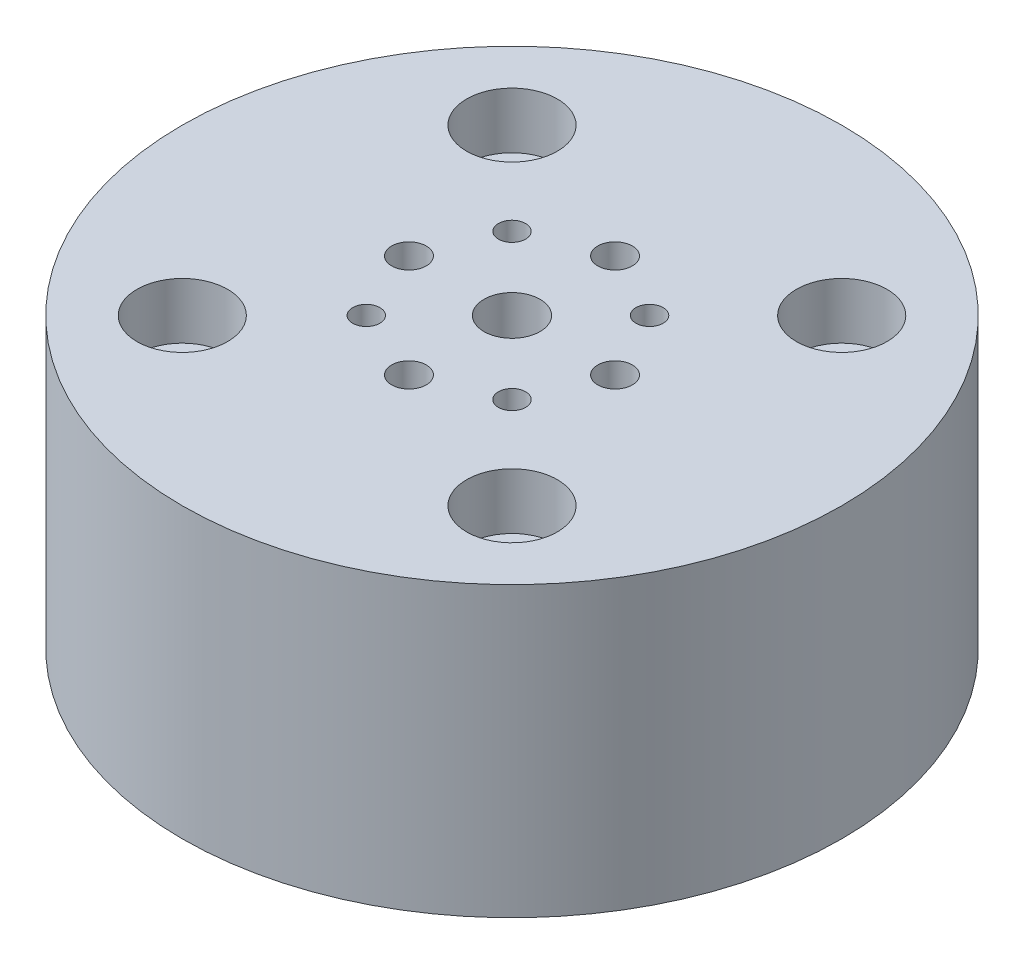
ISO-10303-21;
HEADER;
FILE_DESCRIPTION(('STEP AP214'),'2;1');
FILE_NAME('part.step','',(''),(''),'','','');
FILE_SCHEMA(('AUTOMOTIVE_DESIGN { 1 0 10303 214 1 1 1 1 }'));
ENDSEC;
DATA;
#1=APPLICATION_CONTEXT('core data for automotive mechanical design processes');
#2=APPLICATION_PROTOCOL_DEFINITION('international standard','automotive_design',2000,#1);
#3=PRODUCT_CONTEXT('',#1,'mechanical');
#4=PRODUCT('Part','Part','',(#3));
#5=PRODUCT_RELATED_PRODUCT_CATEGORY('part','',(#4));
#6=PRODUCT_DEFINITION_FORMATION('','',#4);
#7=PRODUCT_DEFINITION_CONTEXT('part definition',#1,'design');
#8=PRODUCT_DEFINITION('design','',#6,#7);
#9=PRODUCT_DEFINITION_SHAPE('','',#8);
#10=(LENGTH_UNIT() NAMED_UNIT(*) SI_UNIT(.MILLI.,.METRE.));
#11=(NAMED_UNIT(*) PLANE_ANGLE_UNIT() SI_UNIT($,.RADIAN.));
#12=(NAMED_UNIT(*) SI_UNIT($,.STERADIAN.) SOLID_ANGLE_UNIT());
#13=UNCERTAINTY_MEASURE_WITH_UNIT(LENGTH_MEASURE(1.E-05),#10,'distance_accuracy_value','');
#14=(GEOMETRIC_REPRESENTATION_CONTEXT(3) GLOBAL_UNCERTAINTY_ASSIGNED_CONTEXT((#13)) GLOBAL_UNIT_ASSIGNED_CONTEXT((#10,
#11,#12)) REPRESENTATION_CONTEXT('',''));
#15=CARTESIAN_POINT('',(0.,0.,0.));
#16=DIRECTION('',(0.,0.,1.));
#17=DIRECTION('',(1.,0.,0.));
#18=AXIS2_PLACEMENT_3D('',#15,#16,#17);
#19=CARTESIAN_POINT('',(0.,35.,0.));
#20=DIRECTION('',(0.,-1.,0.));
#21=DIRECTION('',(0.,0.,-1.));
#22=AXIS2_PLACEMENT_3D('',#19,#20,#21);
#23=CYLINDRICAL_SURFACE('',#22,40.);
#24=CARTESIAN_POINT('',(-17.1947368169029,25.,-36.1156617798628));
#25=CARTESIAN_POINT('',(-17.1947323664606,24.8840909943194,-36.1156643984665));
#26=CARTESIAN_POINT('',(-17.1858855190731,24.768099911168,-36.1198800236044));
#27=CARTESIAN_POINT('',(-17.1507032878378,24.5393178914796,-36.136598365528));
#28=CARTESIAN_POINT('',(-17.1243473274557,24.4265308831518,-36.149110832647));
#29=CARTESIAN_POINT('',(-17.0548559128732,24.2075042348248,-36.1819479586125));
#30=CARTESIAN_POINT('',(-17.0117290480221,24.1012612754539,-36.2022686183693));
#31=CARTESIAN_POINT('',(-16.9098601310666,23.8983055579021,-36.24996245545));
#32=CARTESIAN_POINT('',(-16.8511217518878,23.8015905654,-36.2773339738698));
#33=CARTESIAN_POINT('',(-16.7195367529221,23.6203040089185,-36.3381663516713));
#34=CARTESIAN_POINT('',(-16.6466769583823,23.5357439143212,-36.3716328957112));
#35=CARTESIAN_POINT('',(-16.4888452517058,23.3812653407512,-36.4434559793037));
#36=CARTESIAN_POINT('',(-16.4038728441494,23.3113474609508,-36.4818127188643));
#37=CARTESIAN_POINT('',(-16.2240784376493,23.188106028028,-36.5621247101888));
#38=CARTESIAN_POINT('',(-16.129251136595,23.1347914700836,-36.6040818969207));
#39=CARTESIAN_POINT('',(-15.9323947579528,23.04632780048,-36.6901938859497));
#40=CARTESIAN_POINT('',(-15.8303657375235,23.0111785446647,-36.7343486708041));
#41=CARTESIAN_POINT('',(-15.6220431876525,22.9600737038185,-36.8234243571115));
#42=CARTESIAN_POINT('',(-15.5157535797733,22.944100869252,-36.8683445331304));
#43=CARTESIAN_POINT('',(-15.3018196203172,22.931749043006,-36.9576480579425));
#44=CARTESIAN_POINT('',(-15.1941752799503,22.9353698892986,-37.0020314111717));
#45=CARTESIAN_POINT('',(-14.9807017567811,22.9620883381284,-37.0889720630857));
#46=CARTESIAN_POINT('',(-14.8748709418463,22.9851673754128,-37.1315310617462));
#47=CARTESIAN_POINT('',(-14.667957811744,23.0501182945253,-37.2137530471852));
#48=CARTESIAN_POINT('',(-14.5668755174538,23.0919902589694,-37.2534160212317));
#49=CARTESIAN_POINT('',(-14.3723386834298,23.1933595916023,-37.3289001230808));
#50=CARTESIAN_POINT('',(-14.2788878295692,23.2528654132095,-37.3647193970253));
#51=CARTESIAN_POINT('',(-14.102394183885,23.3878071372108,-37.4316898167842));
#52=CARTESIAN_POINT('',(-14.0193514706958,23.4632431599473,-37.4628409273306));
#53=CARTESIAN_POINT('',(-13.8660264232982,23.6280088764414,-37.5198617430587));
#54=CARTESIAN_POINT('',(-13.7957590904456,23.7173546780933,-37.5457252436978));
#55=CARTESIAN_POINT('',(-13.6701930220048,23.9073471834221,-37.5916254852837));
#56=CARTESIAN_POINT('',(-13.6148942905948,24.0079938902534,-37.6116622246041));
#57=CARTESIAN_POINT('',(-13.5209221243251,24.2177410741905,-37.6455465164637));
#58=CARTESIAN_POINT('',(-13.4822492699932,24.326841846331,-37.6593938528873));
#59=CARTESIAN_POINT('',(-13.422701806529,24.5503957291421,-37.6806592901101));
#60=CARTESIAN_POINT('',(-13.4018270546926,24.6648487968906,-37.688077442458));
#61=CARTESIAN_POINT('',(-13.378524064688,24.8957169313661,-37.696355923557));
#62=CARTESIAN_POINT('',(-13.3760745648113,25.0121295812575,-37.6972238109508));
#63=CARTESIAN_POINT('',(-13.389640495353,25.2437366769446,-37.692407421333));
#64=CARTESIAN_POINT('',(-13.4056558606038,25.3589311270383,-37.6867231674457));
#65=CARTESIAN_POINT('',(-13.4556509223476,25.5847685222988,-37.6689016917543));
#66=CARTESIAN_POINT('',(-13.4896208929858,25.6954138967212,-37.6567679635546));
#67=CARTESIAN_POINT('',(-13.5744933208321,25.9090871745565,-37.626256164323));
#68=CARTESIAN_POINT('',(-13.6253958825829,26.0121150309336,-37.6078780547381));
#69=CARTESIAN_POINT('',(-13.7426623543366,26.2077323494296,-37.5651848622188));
#70=CARTESIAN_POINT('',(-13.8090403965077,26.3003121550391,-37.5408643517187));
#71=CARTESIAN_POINT('',(-13.9552580238635,26.4723082187152,-37.4867554508254));
#72=CARTESIAN_POINT('',(-14.0350977004694,26.551724387377,-37.456967023298));
#73=CARTESIAN_POINT('',(-14.2059651277723,26.6952146187777,-37.3924977063089));
#74=CARTESIAN_POINT('',(-14.2970033732326,26.759274121665,-37.3578122229941));
#75=CARTESIAN_POINT('',(-14.4875388567151,26.8701330603534,-37.2843349099567));
#76=CARTESIAN_POINT('',(-14.5870360561024,26.9169325749813,-37.2455430989889));
#77=CARTESIAN_POINT('',(-14.7915425247515,26.9919176273634,-37.1647997343942));
#78=CARTESIAN_POINT('',(-14.8965490108527,27.0201124678551,-37.1228497716199));
#79=CARTESIAN_POINT('',(-15.1090889651991,27.0571182864119,-37.0368541763514));
#80=CARTESIAN_POINT('',(-15.2166224179383,27.0659293833891,-36.992808556715));
#81=CARTESIAN_POINT('',(-15.4310155799614,27.0639164693807,-36.9038915398826));
#82=CARTESIAN_POINT('',(-15.5378759275429,27.0531152904625,-36.859021163036));
#83=CARTESIAN_POINT('',(-15.7480333355551,27.0122316453215,-36.7697224197646));
#84=CARTESIAN_POINT('',(-15.851330389319,26.9821491430258,-36.725294054167));
#85=CARTESIAN_POINT('',(-16.0514820353814,26.9035615224324,-36.6382565646145));
#86=CARTESIAN_POINT('',(-16.1483365893418,26.8550562945164,-36.5956474514861));
#87=CARTESIAN_POINT('',(-16.3329349899164,26.7410039417887,-36.513633741812));
#88=CARTESIAN_POINT('',(-16.4206791109799,26.6754573305529,-36.4742290487418));
#89=CARTESIAN_POINT('',(-16.5847611493458,26.5291006605521,-36.3999152910998));
#90=CARTESIAN_POINT('',(-16.6610869491391,26.4482745896786,-36.3650110078639));
#91=CARTESIAN_POINT('',(-16.8001779531628,26.2736656996904,-36.3009628117162));
#92=CARTESIAN_POINT('',(-16.8629398184759,26.1798796996346,-36.2718203172845));
#93=CARTESIAN_POINT('',(-16.9732464523444,25.9819355110187,-36.2203344215197));
#94=CARTESIAN_POINT('',(-17.02077605627,25.877767120554,-36.1979977969209));
#95=CARTESIAN_POINT('',(-17.099214821967,25.6621662113375,-36.161011473089));
#96=CARTESIAN_POINT('',(-17.1301435962816,25.5507424396017,-36.1463527035858));
#97=CARTESIAN_POINT('',(-17.1664554527054,25.3655230080593,-36.1291161325999));
#98=CARTESIAN_POINT('',(-17.1770481276471,25.2929267774144,-36.1240789492848));
#99=CARTESIAN_POINT('',(-17.1911902169048,25.1468980216171,-36.1173509445894));
#100=CARTESIAN_POINT('',(-17.1947396376842,25.0734654972321,-36.1156601201382));
#101=CARTESIAN_POINT('',(-17.1947368169029,25.,-36.1156617798628));
#102=B_SPLINE_CURVE_WITH_KNOTS('',3,(#24,#25,#26,#27,#28,#29,#30,#31,#32,#33,#34,#35,#36,#37,
#38,#39,#40,#41,#42,#43,#44,#45,#46,#47,#48,#49,#50,#51,#52,#53,#54,#55,#56,#57,#58,#59,#60,#61,
#62,#63,#64,#65,#66,#67,#68,#69,#70,#71,#72,#73,#74,#75,#76,#77,#78,#79,#80,#81,#82,#83,#84,#85,
#86,#87,#88,#89,#90,#91,#92,#93,#94,#95,#96,#97,#98,#99,#100,#101),.UNSPECIFIED.,.T.,.F.,(4,2,2,
2,2,2,2,2,2,2,2,2,2,2,2,2,2,2,2,2,2,2,2,2,2,2,2,2,2,2,2,2,2,2,2,2,2,2,4),(0.,0.347458837639243,
0.695326729464623,1.04301669219222,1.39062492609941,1.73855904031264,2.08650738951548,
2.43464391998632,2.7827776876714,3.13059806757956,3.47841557122855,3.82590159380766,
4.17338914399238,4.52104354495177,4.86870057231195,5.21676323218792,5.56482598921682,
5.91290089860983,6.26097301713489,6.60864341822748,6.95631259229902,7.30379362970335,
7.65127681251336,7.99907856765509,8.34688268489929,8.69501526691774,9.04314625898657,
9.39110304589265,9.73905769820744,10.0866075310555,10.4341580141263,10.7817105652128,
11.1292526433265,11.4771609676402,11.8251548362552,12.1734940850958,12.5214208882537,
12.7416476044565,12.9618741185652),.UNSPECIFIED.);
#103=CARTESIAN_POINT('',(-17.1947368169029,25.,-36.1156617798628));
#104=VERTEX_POINT('',#103);
#105=EDGE_CURVE('E109',#104,#104,#102,.T.);
#106=ORIENTED_EDGE('',*,*,#105,.T.);
#107=EDGE_LOOP('',(#106));
#108=FACE_BOUND('',#107,.T.);
#109=CARTESIAN_POINT('',(0.,35.,0.));
#110=DIRECTION('',(0.,1.,0.));
#111=DIRECTION('',(0.,0.,1.));
#112=AXIS2_PLACEMENT_3D('',#109,#110,#111);
#113=CIRCLE('',#112,40.);
#114=CARTESIAN_POINT('',(0.,35.,40.));
#115=VERTEX_POINT('',#114);
#116=EDGE_CURVE('E11',#115,#115,#113,.T.);
#117=ORIENTED_EDGE('',*,*,#116,.F.);
#118=EDGE_LOOP('',(#117));
#119=FACE_BOUND('',#118,.T.);
#120=CARTESIAN_POINT('',(0.,0.,0.));
#121=DIRECTION('',(0.,1.,0.));
#122=DIRECTION('',(0.,0.,1.));
#123=AXIS2_PLACEMENT_3D('',#120,#121,#122);
#124=CIRCLE('',#123,40.);
#125=CARTESIAN_POINT('',(0.,0.,40.));
#126=VERTEX_POINT('',#125);
#127=EDGE_CURVE('E60',#126,#126,#124,.T.);
#128=ORIENTED_EDGE('',*,*,#127,.T.);
#129=EDGE_LOOP('',(#128));
#130=FACE_BOUND('',#129,.T.);
#131=ADVANCED_FACE('F45',(#108,#119,#130),#23,.T.);
#132=CARTESIAN_POINT('',(0.,35.,0.));
#133=DIRECTION('',(0.,1.,0.));
#134=DIRECTION('',(0.,0.,1.));
#135=AXIS2_PLACEMENT_3D('',#132,#133,#134);
#136=PLANE('',#135);
#137=CARTESIAN_POINT('',(0.,35.,0.));
#138=DIRECTION('',(0.,1.,0.));
#139=DIRECTION('',(0.,0.,1.));
#140=AXIS2_PLACEMENT_3D('',#137,#138,#139);
#141=CIRCLE('',#140,3.4);
#142=CARTESIAN_POINT('',(0.,35.,3.4));
#143=VERTEX_POINT('',#142);
#144=EDGE_CURVE('E101',#143,#143,#141,.T.);
#145=ORIENTED_EDGE('',*,*,#144,.F.);
#146=EDGE_LOOP('',(#145));
#147=FACE_BOUND('',#146,.T.);
#148=CARTESIAN_POINT('',(-8.83883476483184,35.,-8.83883476483186));
#149=DIRECTION('',(0.,1.,0.));
#150=DIRECTION('',(0.,0.,1.));
#151=AXIS2_PLACEMENT_3D('',#148,#149,#150);
#152=CIRCLE('',#151,1.65);
#153=CARTESIAN_POINT('',(-8.83883476483184,35.,-7.18883476483186));
#154=VERTEX_POINT('',#153);
#155=EDGE_CURVE('E100',#154,#154,#152,.T.);
#156=ORIENTED_EDGE('',*,*,#155,.F.);
#157=EDGE_LOOP('',(#156));
#158=FACE_BOUND('',#157,.T.);
#159=CARTESIAN_POINT('',(8.34372006827231,35.,-8.34372006827231));
#160=DIRECTION('',(0.,1.,0.));
#161=DIRECTION('',(0.,0.,1.));
#162=AXIS2_PLACEMENT_3D('',#159,#160,#161);
#163=CIRCLE('',#162,1.65);
#164=CARTESIAN_POINT('',(8.34372006827231,35.,-6.69372006827231));
#165=VERTEX_POINT('',#164);
#166=EDGE_CURVE('E116',#165,#165,#163,.T.);
#167=ORIENTED_EDGE('',*,*,#166,.F.);
#168=EDGE_LOOP('',(#167));
#169=FACE_BOUND('',#168,.T.);
#170=CARTESIAN_POINT('',(8.8388347648319,35.,8.83883476483179));
#171=DIRECTION('',(0.,1.,0.));
#172=DIRECTION('',(0.,0.,1.));
#173=AXIS2_PLACEMENT_3D('',#170,#171,#172);
#174=CIRCLE('',#173,1.65);
#175=CARTESIAN_POINT('',(8.8388347648319,35.,10.4888347648318));
#176=VERTEX_POINT('',#175);
#177=EDGE_CURVE('E124',#176,#176,#174,.T.);
#178=ORIENTED_EDGE('',*,*,#177,.F.);
#179=EDGE_LOOP('',(#178));
#180=FACE_BOUND('',#179,.T.);
#181=CARTESIAN_POINT('',(-8.83883476483182,35.,8.83883476483187));
#182=DIRECTION('',(0.,1.,0.));
#183=DIRECTION('',(0.,0.,1.));
#184=AXIS2_PLACEMENT_3D('',#181,#182,#183);
#185=CIRCLE('',#184,1.65);
#186=CARTESIAN_POINT('',(-8.83883476483182,35.,10.4888347648319));
#187=VERTEX_POINT('',#186);
#188=EDGE_CURVE('E132',#187,#187,#185,.T.);
#189=ORIENTED_EDGE('',*,*,#188,.F.);
#190=EDGE_LOOP('',(#189));
#191=FACE_BOUND('',#190,.T.);
#192=CARTESIAN_POINT('',(0.,35.,-12.5));
#193=DIRECTION('',(0.,1.,0.));
#194=DIRECTION('',(0.,0.,1.));
#195=AXIS2_PLACEMENT_3D('',#192,#193,#194);
#196=CIRCLE('',#195,2.1);
#197=CARTESIAN_POINT('',(0.,35.,-10.4));
#198=VERTEX_POINT('',#197);
#199=EDGE_CURVE('E140',#198,#198,#196,.T.);
#200=ORIENTED_EDGE('',*,*,#199,.F.);
#201=EDGE_LOOP('',(#200));
#202=FACE_BOUND('',#201,.T.);
#203=CARTESIAN_POINT('',(0.,35.,12.5));
#204=DIRECTION('',(0.,1.,0.));
#205=DIRECTION('',(0.,0.,1.));
#206=AXIS2_PLACEMENT_3D('',#203,#204,#205);
#207=CIRCLE('',#206,2.1);
#208=CARTESIAN_POINT('',(0.,35.,14.6));
#209=VERTEX_POINT('',#208);
#210=EDGE_CURVE('E148',#209,#209,#207,.T.);
#211=ORIENTED_EDGE('',*,*,#210,.F.);
#212=EDGE_LOOP('',(#211));
#213=FACE_BOUND('',#212,.T.);
#214=CARTESIAN_POINT('',(12.5,35.,-1.03686900335528E-13));
#215=DIRECTION('',(0.,1.,0.));
#216=DIRECTION('',(0.,0.,1.));
#217=AXIS2_PLACEMENT_3D('',#214,#215,#216);
#218=CIRCLE('',#217,2.1);
#219=CARTESIAN_POINT('',(12.5,35.,2.09999999999989));
#220=VERTEX_POINT('',#219);
#221=EDGE_CURVE('E156',#220,#220,#218,.T.);
#222=ORIENTED_EDGE('',*,*,#221,.F.);
#223=EDGE_LOOP('',(#222));
#224=FACE_BOUND('',#223,.T.);
#225=CARTESIAN_POINT('',(-12.5,35.,0.));
#226=DIRECTION('',(0.,1.,0.));
#227=DIRECTION('',(0.,0.,1.));
#228=AXIS2_PLACEMENT_3D('',#225,#226,#227);
#229=CIRCLE('',#228,2.1);
#230=CARTESIAN_POINT('',(-12.5,35.,2.1));
#231=VERTEX_POINT('',#230);
#232=EDGE_CURVE('E164',#231,#231,#229,.T.);
#233=ORIENTED_EDGE('',*,*,#232,.F.);
#234=EDGE_LOOP('',(#233));
#235=FACE_BOUND('',#234,.T.);
#236=CARTESIAN_POINT('',(-20.,35.,-20.));
#237=DIRECTION('',(0.,1.,0.));
#238=DIRECTION('',(0.,0.,1.));
#239=AXIS2_PLACEMENT_3D('',#236,#237,#238);
#240=CIRCLE('',#239,5.5);
#241=CARTESIAN_POINT('',(-20.,35.,-14.5));
#242=VERTEX_POINT('',#241);
#243=EDGE_CURVE('E172',#242,#242,#240,.T.);
#244=ORIENTED_EDGE('',*,*,#243,.F.);
#245=EDGE_LOOP('',(#244));
#246=FACE_BOUND('',#245,.T.);
#247=CARTESIAN_POINT('',(20.,35.,-20.));
#248=DIRECTION('',(0.,1.,0.));
#249=DIRECTION('',(0.,0.,1.));
#250=AXIS2_PLACEMENT_3D('',#247,#248,#249);
#251=CIRCLE('',#250,5.5);
#252=CARTESIAN_POINT('',(20.,35.,-14.5));
#253=VERTEX_POINT('',#252);
#254=EDGE_CURVE('E185',#253,#253,#251,.T.);
#255=ORIENTED_EDGE('',*,*,#254,.F.);
#256=EDGE_LOOP('',(#255));
#257=FACE_BOUND('',#256,.T.);
#258=CARTESIAN_POINT('',(20.,35.,20.));
#259=DIRECTION('',(0.,1.,0.));
#260=DIRECTION('',(0.,0.,1.));
#261=AXIS2_PLACEMENT_3D('',#258,#259,#260);
#262=CIRCLE('',#261,5.5);
#263=CARTESIAN_POINT('',(20.,35.,25.5));
#264=VERTEX_POINT('',#263);
#265=EDGE_CURVE('E198',#264,#264,#262,.T.);
#266=ORIENTED_EDGE('',*,*,#265,.F.);
#267=EDGE_LOOP('',(#266));
#268=FACE_BOUND('',#267,.T.);
#269=CARTESIAN_POINT('',(-20.,35.,20.));
#270=DIRECTION('',(0.,1.,0.));
#271=DIRECTION('',(0.,0.,1.));
#272=AXIS2_PLACEMENT_3D('',#269,#270,#271);
#273=CIRCLE('',#272,5.5);
#274=CARTESIAN_POINT('',(-20.,35.,25.5));
#275=VERTEX_POINT('',#274);
#276=EDGE_CURVE('E211',#275,#275,#273,.T.);
#277=ORIENTED_EDGE('',*,*,#276,.F.);
#278=EDGE_LOOP('',(#277));
#279=FACE_BOUND('',#278,.T.);
#280=ORIENTED_EDGE('',*,*,#116,.T.);
#281=EDGE_LOOP('',(#280));
#282=FACE_BOUND('',#281,.T.);
#283=ADVANCED_FACE('F259',(#147,#158,#169,#180,#191,#202,#213,#224,#235,#246,#257,#268,#279,
#282),#136,.T.);
#284=CARTESIAN_POINT('',(0.,0.,0.));
#285=DIRECTION('',(0.,1.,0.));
#286=DIRECTION('',(0.,0.,1.));
#287=AXIS2_PLACEMENT_3D('',#284,#285,#286);
#288=PLANE('',#287);
#289=CARTESIAN_POINT('',(-20.,0.,-20.));
#290=DIRECTION('',(0.,1.,0.));
#291=DIRECTION('',(0.,0.,1.));
#292=AXIS2_PLACEMENT_3D('',#289,#290,#291);
#293=CIRCLE('',#292,3.29999999999999);
#294=CARTESIAN_POINT('',(-20.,0.,-16.7));
#295=VERTEX_POINT('',#294);
#296=EDGE_CURVE('E184',#295,#295,#293,.T.);
#297=ORIENTED_EDGE('',*,*,#296,.T.);
#298=EDGE_LOOP('',(#297));
#299=FACE_BOUND('',#298,.T.);
#300=CARTESIAN_POINT('',(20.,0.,-20.));
#301=DIRECTION('',(0.,1.,0.));
#302=DIRECTION('',(0.,0.,1.));
#303=AXIS2_PLACEMENT_3D('',#300,#301,#302);
#304=CIRCLE('',#303,3.29999999999999);
#305=CARTESIAN_POINT('',(20.,0.,-16.7));
#306=VERTEX_POINT('',#305);
#307=EDGE_CURVE('E197',#306,#306,#304,.T.);
#308=ORIENTED_EDGE('',*,*,#307,.T.);
#309=EDGE_LOOP('',(#308));
#310=FACE_BOUND('',#309,.T.);
#311=CARTESIAN_POINT('',(20.,0.,20.));
#312=DIRECTION('',(0.,1.,0.));
#313=DIRECTION('',(0.,0.,1.));
#314=AXIS2_PLACEMENT_3D('',#311,#312,#313);
#315=CIRCLE('',#314,3.29999999999999);
#316=CARTESIAN_POINT('',(20.,0.,23.3));
#317=VERTEX_POINT('',#316);
#318=EDGE_CURVE('E210',#317,#317,#315,.T.);
#319=ORIENTED_EDGE('',*,*,#318,.T.);
#320=EDGE_LOOP('',(#319));
#321=FACE_BOUND('',#320,.T.);
#322=CARTESIAN_POINT('',(-20.,0.,20.));
#323=DIRECTION('',(0.,1.,0.));
#324=DIRECTION('',(0.,0.,1.));
#325=AXIS2_PLACEMENT_3D('',#322,#323,#324);
#326=CIRCLE('',#325,3.29999999999999);
#327=CARTESIAN_POINT('',(-20.,0.,23.3));
#328=VERTEX_POINT('',#327);
#329=EDGE_CURVE('E222',#328,#328,#326,.T.);
#330=ORIENTED_EDGE('',*,*,#329,.T.);
#331=EDGE_LOOP('',(#330));
#332=FACE_BOUND('',#331,.T.);
#333=ORIENTED_EDGE('',*,*,#127,.F.);
#334=EDGE_LOOP('',(#333));
#335=FACE_BOUND('',#334,.T.);
#336=ADVANCED_FACE('F239',(#299,#310,#321,#332,#335),#288,.F.);
#337=CARTESIAN_POINT('',(-20.,35.,20.));
#338=DIRECTION('',(0.,1.,0.));
#339=DIRECTION('',(0.,0.,1.));
#340=AXIS2_PLACEMENT_3D('',#337,#338,#339);
#341=CYLINDRICAL_SURFACE('',#340,3.29999999999999);
#342=CARTESIAN_POINT('',(-20.,28.2,20.));
#343=DIRECTION('',(0.,1.,0.));
#344=DIRECTION('',(0.,0.,1.));
#345=AXIS2_PLACEMENT_3D('',#342,#343,#344);
#346=CIRCLE('',#345,3.3);
#347=CARTESIAN_POINT('',(-20.,28.2,23.3));
#348=VERTEX_POINT('',#347);
#349=EDGE_CURVE('E219',#348,#348,#346,.T.);
#350=ORIENTED_EDGE('',*,*,#349,.T.);
#351=EDGE_LOOP('',(#350));
#352=FACE_BOUND('',#351,.T.);
#353=ORIENTED_EDGE('',*,*,#329,.F.);
#354=EDGE_LOOP('',(#353));
#355=FACE_BOUND('',#354,.T.);
#356=ADVANCED_FACE('F274',(#352,#355),#341,.F.);
#357=CARTESIAN_POINT('',(-16.7,28.2,20.));
#358=DIRECTION('',(0.,-1.,0.));
#359=DIRECTION('',(0.,0.,-1.));
#360=AXIS2_PLACEMENT_3D('',#357,#358,#359);
#361=PLANE('',#360);
#362=ORIENTED_EDGE('',*,*,#349,.F.);
#363=EDGE_LOOP('',(#362));
#364=FACE_BOUND('',#363,.T.);
#365=CARTESIAN_POINT('',(-20.,28.2,20.));
#366=DIRECTION('',(0.,1.,0.));
#367=DIRECTION('',(0.,0.,1.));
#368=AXIS2_PLACEMENT_3D('',#365,#366,#367);
#369=CIRCLE('',#368,5.5);
#370=CARTESIAN_POINT('',(-20.,28.2,25.5));
#371=VERTEX_POINT('',#370);
#372=EDGE_CURVE('E215',#371,#371,#369,.T.);
#373=ORIENTED_EDGE('',*,*,#372,.T.);
#374=EDGE_LOOP('',(#373));
#375=FACE_BOUND('',#374,.T.);
#376=ADVANCED_FACE('F278',(#364,#375),#361,.F.);
#377=CARTESIAN_POINT('',(-20.,35.,20.));
#378=DIRECTION('',(0.,1.,0.));
#379=DIRECTION('',(0.,0.,1.));
#380=AXIS2_PLACEMENT_3D('',#377,#378,#379);
#381=CYLINDRICAL_SURFACE('',#380,5.5);
#382=ORIENTED_EDGE('',*,*,#372,.F.);
#383=EDGE_LOOP('',(#382));
#384=FACE_BOUND('',#383,.T.);
#385=ORIENTED_EDGE('',*,*,#276,.T.);
#386=EDGE_LOOP('',(#385));
#387=FACE_BOUND('',#386,.T.);
#388=ADVANCED_FACE('F284',(#384,#387),#381,.F.);
#389=CARTESIAN_POINT('',(20.,35.,20.));
#390=DIRECTION('',(0.,1.,0.));
#391=DIRECTION('',(0.,0.,1.));
#392=AXIS2_PLACEMENT_3D('',#389,#390,#391);
#393=CYLINDRICAL_SURFACE('',#392,3.29999999999999);
#394=CARTESIAN_POINT('',(20.,28.2,20.));
#395=DIRECTION('',(0.,1.,0.));
#396=DIRECTION('',(0.,0.,1.));
#397=AXIS2_PLACEMENT_3D('',#394,#395,#396);
#398=CIRCLE('',#397,3.3);
#399=CARTESIAN_POINT('',(20.,28.2,23.3));
#400=VERTEX_POINT('',#399);
#401=EDGE_CURVE('E206',#400,#400,#398,.T.);
#402=ORIENTED_EDGE('',*,*,#401,.T.);
#403=EDGE_LOOP('',(#402));
#404=FACE_BOUND('',#403,.T.);
#405=ORIENTED_EDGE('',*,*,#318,.F.);
#406=EDGE_LOOP('',(#405));
#407=FACE_BOUND('',#406,.T.);
#408=ADVANCED_FACE('F288',(#404,#407),#393,.F.);
#409=CARTESIAN_POINT('',(23.3,28.2,20.));
#410=DIRECTION('',(0.,-1.,0.));
#411=DIRECTION('',(0.,0.,-1.));
#412=AXIS2_PLACEMENT_3D('',#409,#410,#411);
#413=PLANE('',#412);
#414=ORIENTED_EDGE('',*,*,#401,.F.);
#415=EDGE_LOOP('',(#414));
#416=FACE_BOUND('',#415,.T.);
#417=CARTESIAN_POINT('',(20.,28.2,20.));
#418=DIRECTION('',(0.,1.,0.));
#419=DIRECTION('',(0.,0.,1.));
#420=AXIS2_PLACEMENT_3D('',#417,#418,#419);
#421=CIRCLE('',#420,5.5);
#422=CARTESIAN_POINT('',(20.,28.2,25.5));
#423=VERTEX_POINT('',#422);
#424=EDGE_CURVE('E202',#423,#423,#421,.T.);
#425=ORIENTED_EDGE('',*,*,#424,.T.);
#426=EDGE_LOOP('',(#425));
#427=FACE_BOUND('',#426,.T.);
#428=ADVANCED_FACE('F292',(#416,#427),#413,.F.);
#429=CARTESIAN_POINT('',(20.,35.,20.));
#430=DIRECTION('',(0.,1.,0.));
#431=DIRECTION('',(0.,0.,1.));
#432=AXIS2_PLACEMENT_3D('',#429,#430,#431);
#433=CYLINDRICAL_SURFACE('',#432,5.5);
#434=ORIENTED_EDGE('',*,*,#424,.F.);
#435=EDGE_LOOP('',(#434));
#436=FACE_BOUND('',#435,.T.);
#437=ORIENTED_EDGE('',*,*,#265,.T.);
#438=EDGE_LOOP('',(#437));
#439=FACE_BOUND('',#438,.T.);
#440=ADVANCED_FACE('F296',(#436,#439),#433,.F.);
#441=CARTESIAN_POINT('',(20.,35.,-20.));
#442=DIRECTION('',(0.,1.,0.));
#443=DIRECTION('',(0.,0.,1.));
#444=AXIS2_PLACEMENT_3D('',#441,#442,#443);
#445=CYLINDRICAL_SURFACE('',#444,3.29999999999999);
#446=CARTESIAN_POINT('',(20.,28.2,-20.));
#447=DIRECTION('',(0.,1.,0.));
#448=DIRECTION('',(0.,0.,1.));
#449=AXIS2_PLACEMENT_3D('',#446,#447,#448);
#450=CIRCLE('',#449,3.3);
#451=CARTESIAN_POINT('',(20.,28.2,-16.7));
#452=VERTEX_POINT('',#451);
#453=EDGE_CURVE('E193',#452,#452,#450,.T.);
#454=ORIENTED_EDGE('',*,*,#453,.T.);
#455=EDGE_LOOP('',(#454));
#456=FACE_BOUND('',#455,.T.);
#457=ORIENTED_EDGE('',*,*,#307,.F.);
#458=EDGE_LOOP('',(#457));
#459=FACE_BOUND('',#458,.T.);
#460=ADVANCED_FACE('F300',(#456,#459),#445,.F.);
#461=CARTESIAN_POINT('',(23.3,28.2,-20.));
#462=DIRECTION('',(0.,-1.,0.));
#463=DIRECTION('',(0.,0.,-1.));
#464=AXIS2_PLACEMENT_3D('',#461,#462,#463);
#465=PLANE('',#464);
#466=ORIENTED_EDGE('',*,*,#453,.F.);
#467=EDGE_LOOP('',(#466));
#468=FACE_BOUND('',#467,.T.);
#469=CARTESIAN_POINT('',(20.,28.2,-20.));
#470=DIRECTION('',(0.,1.,0.));
#471=DIRECTION('',(0.,0.,1.));
#472=AXIS2_PLACEMENT_3D('',#469,#470,#471);
#473=CIRCLE('',#472,5.5);
#474=CARTESIAN_POINT('',(20.,28.2,-14.5));
#475=VERTEX_POINT('',#474);
#476=EDGE_CURVE('E189',#475,#475,#473,.T.);
#477=ORIENTED_EDGE('',*,*,#476,.T.);
#478=EDGE_LOOP('',(#477));
#479=FACE_BOUND('',#478,.T.);
#480=ADVANCED_FACE('F255',(#468,#479),#465,.F.);
#481=CARTESIAN_POINT('',(20.,35.,-20.));
#482=DIRECTION('',(0.,1.,0.));
#483=DIRECTION('',(0.,0.,1.));
#484=AXIS2_PLACEMENT_3D('',#481,#482,#483);
#485=CYLINDRICAL_SURFACE('',#484,5.5);
#486=ORIENTED_EDGE('',*,*,#476,.F.);
#487=EDGE_LOOP('',(#486));
#488=FACE_BOUND('',#487,.T.);
#489=ORIENTED_EDGE('',*,*,#254,.T.);
#490=EDGE_LOOP('',(#489));
#491=FACE_BOUND('',#490,.T.);
#492=ADVANCED_FACE('F245',(#488,#491),#485,.F.);
#493=CARTESIAN_POINT('',(-20.,35.,-20.));
#494=DIRECTION('',(0.,1.,0.));
#495=DIRECTION('',(0.,0.,1.));
#496=AXIS2_PLACEMENT_3D('',#493,#494,#495);
#497=CYLINDRICAL_SURFACE('',#496,3.29999999999999);
#498=CARTESIAN_POINT('',(-20.,28.2,-20.));
#499=DIRECTION('',(0.,1.,0.));
#500=DIRECTION('',(0.,0.,1.));
#501=AXIS2_PLACEMENT_3D('',#498,#499,#500);
#502=CIRCLE('',#501,3.3);
#503=CARTESIAN_POINT('',(-20.,28.2,-16.7));
#504=VERTEX_POINT('',#503);
#505=EDGE_CURVE('E180',#504,#504,#502,.T.);
#506=ORIENTED_EDGE('',*,*,#505,.T.);
#507=EDGE_LOOP('',(#506));
#508=FACE_BOUND('',#507,.T.);
#509=ORIENTED_EDGE('',*,*,#296,.F.);
#510=EDGE_LOOP('',(#509));
#511=FACE_BOUND('',#510,.T.);
#512=ADVANCED_FACE('F242',(#508,#511),#497,.F.);
#513=CARTESIAN_POINT('',(-16.7,28.2,-20.));
#514=DIRECTION('',(0.,-1.,0.));
#515=DIRECTION('',(0.,0.,-1.));
#516=AXIS2_PLACEMENT_3D('',#513,#514,#515);
#517=PLANE('',#516);
#518=ORIENTED_EDGE('',*,*,#505,.F.);
#519=EDGE_LOOP('',(#518));
#520=FACE_BOUND('',#519,.T.);
#521=CARTESIAN_POINT('',(-20.,28.2,-20.));
#522=DIRECTION('',(0.,1.,0.));
#523=DIRECTION('',(0.,0.,1.));
#524=AXIS2_PLACEMENT_3D('',#521,#522,#523);
#525=CIRCLE('',#524,5.5);
#526=CARTESIAN_POINT('',(-20.,28.2,-14.5));
#527=VERTEX_POINT('',#526);
#528=EDGE_CURVE('E176',#527,#527,#525,.T.);
#529=ORIENTED_EDGE('',*,*,#528,.T.);
#530=EDGE_LOOP('',(#529));
#531=FACE_BOUND('',#530,.T.);
#532=ADVANCED_FACE('F244',(#520,#531),#517,.F.);
#533=CARTESIAN_POINT('',(-20.,35.,-20.));
#534=DIRECTION('',(0.,1.,0.));
#535=DIRECTION('',(0.,0.,1.));
#536=AXIS2_PLACEMENT_3D('',#533,#534,#535);
#537=CYLINDRICAL_SURFACE('',#536,5.5);
#538=ORIENTED_EDGE('',*,*,#528,.F.);
#539=EDGE_LOOP('',(#538));
#540=FACE_BOUND('',#539,.T.);
#541=ORIENTED_EDGE('',*,*,#243,.T.);
#542=EDGE_LOOP('',(#541));
#543=FACE_BOUND('',#542,.T.);
#544=ADVANCED_FACE('F252',(#540,#543),#537,.F.);
#545=CARTESIAN_POINT('',(-12.5,22.6,0.));
#546=DIRECTION('',(0.,1.,0.));
#547=DIRECTION('',(0.,0.,1.));
#548=AXIS2_PLACEMENT_3D('',#545,#546,#547);
#549=CONICAL_SURFACE('',#548,2.1,1.02974425867665);
#550=CARTESIAN_POINT('',(-12.5,21.3381927000421,0.));
#551=VERTEX_POINT('',#550);
#552=VERTEX_LOOP('',#551);
#553=FACE_BOUND('',#552,.T.);
#554=CARTESIAN_POINT('',(-12.5,22.6,0.));
#555=DIRECTION('',(0.,1.,0.));
#556=DIRECTION('',(0.,0.,1.));
#557=AXIS2_PLACEMENT_3D('',#554,#555,#556);
#558=CIRCLE('',#557,2.1);
#559=CARTESIAN_POINT('',(-12.5,22.6,2.1));
#560=VERTEX_POINT('',#559);
#561=EDGE_CURVE('E168',#560,#560,#558,.T.);
#562=ORIENTED_EDGE('',*,*,#561,.T.);
#563=EDGE_LOOP('',(#562));
#564=FACE_BOUND('',#563,.T.);
#565=ADVANCED_FACE('F355',(#553,#564),#549,.F.);
#566=CARTESIAN_POINT('',(-12.5,35.,0.));
#567=DIRECTION('',(0.,1.,0.));
#568=DIRECTION('',(0.,0.,1.));
#569=AXIS2_PLACEMENT_3D('',#566,#567,#568);
#570=CYLINDRICAL_SURFACE('',#569,2.1);
#571=ORIENTED_EDGE('',*,*,#561,.F.);
#572=EDGE_LOOP('',(#571));
#573=FACE_BOUND('',#572,.T.);
#574=ORIENTED_EDGE('',*,*,#232,.T.);
#575=EDGE_LOOP('',(#574));
#576=FACE_BOUND('',#575,.T.);
#577=ADVANCED_FACE('F365',(#573,#576),#570,.F.);
#578=CARTESIAN_POINT('',(12.5,22.6,-1.03686900335528E-13));
#579=DIRECTION('',(0.,1.,0.));
#580=DIRECTION('',(0.,0.,1.));
#581=AXIS2_PLACEMENT_3D('',#578,#579,#580);
#582=CONICAL_SURFACE('',#581,2.1,1.02974425867665);
#583=CARTESIAN_POINT('',(12.5,21.3381927000421,-1.03686900335528E-13));
#584=VERTEX_POINT('',#583);
#585=VERTEX_LOOP('',#584);
#586=FACE_BOUND('',#585,.T.);
#587=CARTESIAN_POINT('',(12.5,22.6,-1.03686900335528E-13));
#588=DIRECTION('',(0.,1.,0.));
#589=DIRECTION('',(0.,0.,1.));
#590=AXIS2_PLACEMENT_3D('',#587,#588,#589);
#591=CIRCLE('',#590,2.1);
#592=CARTESIAN_POINT('',(12.5,22.6,2.09999999999989));
#593=VERTEX_POINT('',#592);
#594=EDGE_CURVE('E160',#593,#593,#591,.T.);
#595=ORIENTED_EDGE('',*,*,#594,.T.);
#596=EDGE_LOOP('',(#595));
#597=FACE_BOUND('',#596,.T.);
#598=ADVANCED_FACE('F375',(#586,#597),#582,.F.);
#599=CARTESIAN_POINT('',(12.5,35.,-1.03686900335528E-13));
#600=DIRECTION('',(0.,1.,0.));
#601=DIRECTION('',(0.,0.,1.));
#602=AXIS2_PLACEMENT_3D('',#599,#600,#601);
#603=CYLINDRICAL_SURFACE('',#602,2.1);
#604=ORIENTED_EDGE('',*,*,#594,.F.);
#605=EDGE_LOOP('',(#604));
#606=FACE_BOUND('',#605,.T.);
#607=ORIENTED_EDGE('',*,*,#221,.T.);
#608=EDGE_LOOP('',(#607));
#609=FACE_BOUND('',#608,.T.);
#610=ADVANCED_FACE('F387',(#606,#609),#603,.F.);
#611=CARTESIAN_POINT('',(0.,22.6,12.5));
#612=DIRECTION('',(0.,1.,0.));
#613=DIRECTION('',(0.,0.,1.));
#614=AXIS2_PLACEMENT_3D('',#611,#612,#613);
#615=CONICAL_SURFACE('',#614,2.1,1.02974425867665);
#616=CARTESIAN_POINT('',(0.,21.3381927000421,12.5));
#617=VERTEX_POINT('',#616);
#618=VERTEX_LOOP('',#617);
#619=FACE_BOUND('',#618,.T.);
#620=CARTESIAN_POINT('',(0.,22.6,12.5));
#621=DIRECTION('',(0.,1.,0.));
#622=DIRECTION('',(0.,0.,1.));
#623=AXIS2_PLACEMENT_3D('',#620,#621,#622);
#624=CIRCLE('',#623,2.1);
#625=CARTESIAN_POINT('',(0.,22.6,14.6));
#626=VERTEX_POINT('',#625);
#627=EDGE_CURVE('E152',#626,#626,#624,.T.);
#628=ORIENTED_EDGE('',*,*,#627,.T.);
#629=EDGE_LOOP('',(#628));
#630=FACE_BOUND('',#629,.T.);
#631=ADVANCED_FACE('F396',(#619,#630),#615,.F.);
#632=CARTESIAN_POINT('',(0.,35.,12.5));
#633=DIRECTION('',(0.,1.,0.));
#634=DIRECTION('',(0.,0.,1.));
#635=AXIS2_PLACEMENT_3D('',#632,#633,#634);
#636=CYLINDRICAL_SURFACE('',#635,2.1);
#637=ORIENTED_EDGE('',*,*,#627,.F.);
#638=EDGE_LOOP('',(#637));
#639=FACE_BOUND('',#638,.T.);
#640=ORIENTED_EDGE('',*,*,#210,.T.);
#641=EDGE_LOOP('',(#640));
#642=FACE_BOUND('',#641,.T.);
#643=ADVANCED_FACE('F408',(#639,#642),#636,.F.);
#644=CARTESIAN_POINT('',(0.,22.6,-12.5));
#645=DIRECTION('',(0.,1.,0.));
#646=DIRECTION('',(0.,0.,1.));
#647=AXIS2_PLACEMENT_3D('',#644,#645,#646);
#648=CONICAL_SURFACE('',#647,2.1,1.02974425867665);
#649=CARTESIAN_POINT('',(0.,21.3381927000421,-12.5));
#650=VERTEX_POINT('',#649);
#651=VERTEX_LOOP('',#650);
#652=FACE_BOUND('',#651,.T.);
#653=CARTESIAN_POINT('',(0.,22.6,-12.5));
#654=DIRECTION('',(0.,1.,0.));
#655=DIRECTION('',(0.,0.,1.));
#656=AXIS2_PLACEMENT_3D('',#653,#654,#655);
#657=CIRCLE('',#656,2.1);
#658=CARTESIAN_POINT('',(0.,22.6,-10.4));
#659=VERTEX_POINT('',#658);
#660=EDGE_CURVE('E144',#659,#659,#657,.T.);
#661=ORIENTED_EDGE('',*,*,#660,.T.);
#662=EDGE_LOOP('',(#661));
#663=FACE_BOUND('',#662,.T.);
#664=ADVANCED_FACE('F418',(#652,#663),#648,.F.);
#665=CARTESIAN_POINT('',(0.,35.,-12.5));
#666=DIRECTION('',(0.,1.,0.));
#667=DIRECTION('',(0.,0.,1.));
#668=AXIS2_PLACEMENT_3D('',#665,#666,#667);
#669=CYLINDRICAL_SURFACE('',#668,2.1);
#670=ORIENTED_EDGE('',*,*,#660,.F.);
#671=EDGE_LOOP('',(#670));
#672=FACE_BOUND('',#671,.T.);
#673=ORIENTED_EDGE('',*,*,#199,.T.);
#674=EDGE_LOOP('',(#673));
#675=FACE_BOUND('',#674,.T.);
#676=ADVANCED_FACE('F430',(#672,#675),#669,.F.);
#677=CARTESIAN_POINT('',(-8.83883476483182,24.9,8.83883476483187));
#678=DIRECTION('',(0.,1.,0.));
#679=DIRECTION('',(0.,0.,1.));
#680=AXIS2_PLACEMENT_3D('',#677,#678,#679);
#681=CONICAL_SURFACE('',#680,1.65,1.02974425867665);
#682=CARTESIAN_POINT('',(-8.83883476483183,23.9085799786045,8.83883476483187));
#683=VERTEX_POINT('',#682);
#684=VERTEX_LOOP('',#683);
#685=FACE_BOUND('',#684,.T.);
#686=CARTESIAN_POINT('',(-8.83883476483182,24.9,8.83883476483187));
#687=DIRECTION('',(0.,1.,0.));
#688=DIRECTION('',(0.,0.,1.));
#689=AXIS2_PLACEMENT_3D('',#686,#687,#688);
#690=CIRCLE('',#689,1.65);
#691=CARTESIAN_POINT('',(-8.83883476483182,24.9,10.4888347648319));
#692=VERTEX_POINT('',#691);
#693=EDGE_CURVE('E136',#692,#692,#690,.T.);
#694=ORIENTED_EDGE('',*,*,#693,.T.);
#695=EDGE_LOOP('',(#694));
#696=FACE_BOUND('',#695,.T.);
#697=ADVANCED_FACE('F440',(#685,#696),#681,.F.);
#698=CARTESIAN_POINT('',(-8.83883476483182,35.,8.83883476483187));
#699=DIRECTION('',(0.,1.,0.));
#700=DIRECTION('',(0.,0.,1.));
#701=AXIS2_PLACEMENT_3D('',#698,#699,#700);
#702=CYLINDRICAL_SURFACE('',#701,1.65);
#703=ORIENTED_EDGE('',*,*,#693,.F.);
#704=EDGE_LOOP('',(#703));
#705=FACE_BOUND('',#704,.T.);
#706=ORIENTED_EDGE('',*,*,#188,.T.);
#707=EDGE_LOOP('',(#706));
#708=FACE_BOUND('',#707,.T.);
#709=ADVANCED_FACE('F452',(#705,#708),#702,.F.);
#710=CARTESIAN_POINT('',(8.8388347648319,24.9,8.83883476483179));
#711=DIRECTION('',(0.,1.,0.));
#712=DIRECTION('',(0.,0.,1.));
#713=AXIS2_PLACEMENT_3D('',#710,#711,#712);
#714=CONICAL_SURFACE('',#713,1.65,1.02974425867665);
#715=CARTESIAN_POINT('',(8.83883476483189,23.9085799786045,8.83883476483179));
#716=VERTEX_POINT('',#715);
#717=VERTEX_LOOP('',#716);
#718=FACE_BOUND('',#717,.T.);
#719=CARTESIAN_POINT('',(8.8388347648319,24.9,8.83883476483179));
#720=DIRECTION('',(0.,1.,0.));
#721=DIRECTION('',(0.,0.,1.));
#722=AXIS2_PLACEMENT_3D('',#719,#720,#721);
#723=CIRCLE('',#722,1.65);
#724=CARTESIAN_POINT('',(8.8388347648319,24.9,10.4888347648318));
#725=VERTEX_POINT('',#724);
#726=EDGE_CURVE('E128',#725,#725,#723,.T.);
#727=ORIENTED_EDGE('',*,*,#726,.T.);
#728=EDGE_LOOP('',(#727));
#729=FACE_BOUND('',#728,.T.);
#730=ADVANCED_FACE('F462',(#718,#729),#714,.F.);
#731=CARTESIAN_POINT('',(8.8388347648319,35.,8.83883476483179));
#732=DIRECTION('',(0.,1.,0.));
#733=DIRECTION('',(0.,0.,1.));
#734=AXIS2_PLACEMENT_3D('',#731,#732,#733);
#735=CYLINDRICAL_SURFACE('',#734,1.65);
#736=ORIENTED_EDGE('',*,*,#726,.F.);
#737=EDGE_LOOP('',(#736));
#738=FACE_BOUND('',#737,.T.);
#739=ORIENTED_EDGE('',*,*,#177,.T.);
#740=EDGE_LOOP('',(#739));
#741=FACE_BOUND('',#740,.T.);
#742=ADVANCED_FACE('F474',(#738,#741),#735,.F.);
#743=CARTESIAN_POINT('',(8.34372006827231,24.9,-8.34372006827231));
#744=DIRECTION('',(0.,1.,0.));
#745=DIRECTION('',(0.,0.,1.));
#746=AXIS2_PLACEMENT_3D('',#743,#744,#745);
#747=CONICAL_SURFACE('',#746,1.65,1.02974425867665);
#748=CARTESIAN_POINT('',(8.34372006827231,23.9085799786045,-8.34372006827231));
#749=VERTEX_POINT('',#748);
#750=VERTEX_LOOP('',#749);
#751=FACE_BOUND('',#750,.T.);
#752=CARTESIAN_POINT('',(8.34372006827231,24.9,-8.34372006827231));
#753=DIRECTION('',(0.,1.,0.));
#754=DIRECTION('',(0.,0.,1.));
#755=AXIS2_PLACEMENT_3D('',#752,#753,#754);
#756=CIRCLE('',#755,1.65);
#757=CARTESIAN_POINT('',(8.34372006827231,24.9,-6.69372006827231));
#758=VERTEX_POINT('',#757);
#759=EDGE_CURVE('E120',#758,#758,#756,.T.);
#760=ORIENTED_EDGE('',*,*,#759,.T.);
#761=EDGE_LOOP('',(#760));
#762=FACE_BOUND('',#761,.T.);
#763=ADVANCED_FACE('F484',(#751,#762),#747,.F.);
#764=CARTESIAN_POINT('',(8.34372006827231,35.,-8.34372006827231));
#765=DIRECTION('',(0.,1.,0.));
#766=DIRECTION('',(0.,0.,1.));
#767=AXIS2_PLACEMENT_3D('',#764,#765,#766);
#768=CYLINDRICAL_SURFACE('',#767,1.65);
#769=ORIENTED_EDGE('',*,*,#759,.F.);
#770=EDGE_LOOP('',(#769));
#771=FACE_BOUND('',#770,.T.);
#772=ORIENTED_EDGE('',*,*,#166,.T.);
#773=EDGE_LOOP('',(#772));
#774=FACE_BOUND('',#773,.T.);
#775=ADVANCED_FACE('F496',(#771,#774),#768,.F.);
#776=CARTESIAN_POINT('',(-8.83883476483184,24.9,-8.83883476483186));
#777=DIRECTION('',(0.,1.,0.));
#778=DIRECTION('',(0.,0.,1.));
#779=AXIS2_PLACEMENT_3D('',#776,#777,#778);
#780=CONICAL_SURFACE('',#779,1.65,1.02974425867665);
#781=CARTESIAN_POINT('',(-8.83883476483184,23.9085799786045,-8.83883476483186));
#782=VERTEX_POINT('',#781);
#783=VERTEX_LOOP('',#782);
#784=FACE_BOUND('',#783,.T.);
#785=CARTESIAN_POINT('',(-8.83883476483184,24.9,-8.83883476483186));
#786=DIRECTION('',(0.,1.,0.));
#787=DIRECTION('',(0.,0.,1.));
#788=AXIS2_PLACEMENT_3D('',#785,#786,#787);
#789=CIRCLE('',#788,1.65);
#790=CARTESIAN_POINT('',(-8.83883476483184,24.9,-7.18883476483186));
#791=VERTEX_POINT('',#790);
#792=EDGE_CURVE('E106',#791,#791,#789,.T.);
#793=ORIENTED_EDGE('',*,*,#792,.T.);
#794=EDGE_LOOP('',(#793));
#795=FACE_BOUND('',#794,.T.);
#796=ADVANCED_FACE('F506',(#784,#795),#780,.F.);
#797=CARTESIAN_POINT('',(-8.83883476483184,35.,-8.83883476483186));
#798=DIRECTION('',(0.,1.,0.));
#799=DIRECTION('',(0.,0.,1.));
#800=AXIS2_PLACEMENT_3D('',#797,#798,#799);
#801=CYLINDRICAL_SURFACE('',#800,1.65);
#802=ORIENTED_EDGE('',*,*,#792,.F.);
#803=EDGE_LOOP('',(#802));
#804=FACE_BOUND('',#803,.T.);
#805=ORIENTED_EDGE('',*,*,#155,.T.);
#806=EDGE_LOOP('',(#805));
#807=FACE_BOUND('',#806,.T.);
#808=ADVANCED_FACE('F93',(#804,#807),#801,.F.);
#809=CARTESIAN_POINT('',(0.,15.25,0.));
#810=DIRECTION('',(0.,1.,0.));
#811=DIRECTION('',(0.,0.,1.));
#812=AXIS2_PLACEMENT_3D('',#809,#810,#811);
#813=CONICAL_SURFACE('',#812,3.4,1.02974425867665);
#814=CARTESIAN_POINT('',(0.,13.2070738953063,0.));
#815=VERTEX_POINT('',#814);
#816=VERTEX_LOOP('',#815);
#817=FACE_BOUND('',#816,.T.);
#818=CARTESIAN_POINT('',(0.,15.25,0.));
#819=DIRECTION('',(0.,1.,0.));
#820=DIRECTION('',(0.,0.,1.));
#821=AXIS2_PLACEMENT_3D('',#818,#819,#820);
#822=CIRCLE('',#821,3.4);
#823=CARTESIAN_POINT('',(0.,15.25,3.4));
#824=VERTEX_POINT('',#823);
#825=EDGE_CURVE('E97',#824,#824,#822,.T.);
#826=ORIENTED_EDGE('',*,*,#825,.T.);
#827=EDGE_LOOP('',(#826));
#828=FACE_BOUND('',#827,.T.);
#829=ADVANCED_FACE('F89',(#817,#828),#813,.F.);
#830=CARTESIAN_POINT('',(0.,35.,0.));
#831=DIRECTION('',(0.,1.,0.));
#832=DIRECTION('',(0.,0.,1.));
#833=AXIS2_PLACEMENT_3D('',#830,#831,#832);
#834=CYLINDRICAL_SURFACE('',#833,3.4);
#835=CARTESIAN_POINT('',(-2.94146567967263,25.,-1.70522129218117));
#836=CARTESIAN_POINT('',(-2.94146346803554,25.1033632107313,-1.70523283684204));
#837=CARTESIAN_POINT('',(-2.9365430861561,25.2069184050614,-1.71380004810493));
#838=CARTESIAN_POINT('',(-2.91695596994268,25.4106244715559,-1.74691499925912));
#839=CARTESIAN_POINT('',(-2.90225952801172,25.5107639860019,-1.77151144431805));
#840=CARTESIAN_POINT('',(-2.86349576166649,25.7040706896693,-1.83349428256812));
#841=CARTESIAN_POINT('',(-2.83950569563147,25.7972880015353,-1.87077492812337));
#842=CARTESIAN_POINT('',(-2.78227999186016,25.9761740550427,-1.95486563061895));
#843=CARTESIAN_POINT('',(-2.74904510313819,26.0618434074786,-2.00167491546784));
#844=CARTESIAN_POINT('',(-2.66847294264365,26.2350763399948,-2.10813760483386));
#845=CARTESIAN_POINT('',(-2.61988744403134,26.3215220632826,-2.16866603322479));
#846=CARTESIAN_POINT('',(-2.5105835229393,26.4827109105372,-2.29432261599709));
#847=CARTESIAN_POINT('',(-2.44985497459167,26.5574441742978,-2.35945457967973));
#848=CARTESIAN_POINT('',(-2.30854353653309,26.7013340285416,-2.49829698119065));
#849=CARTESIAN_POINT('',(-2.22650142365766,26.7689381068348,-2.57215375126245));
#850=CARTESIAN_POINT('',(-2.0475355715368,26.8851513412382,-2.71675992206947));
#851=CARTESIAN_POINT('',(-1.95062598884817,26.9337784124656,-2.78751219729044));
#852=CARTESIAN_POINT('',(-1.75388428076533,27.0055919784208,-2.91483351093785));
#853=CARTESIAN_POINT('',(-1.65525335862995,27.030793011483,-2.97211273391256));
#854=CARTESIAN_POINT('',(-1.45029107378141,27.0618634762281,-3.07731648428089));
#855=CARTESIAN_POINT('',(-1.34396730070976,27.0677517028285,-3.12525006394093));
#856=CARTESIAN_POINT('',(-1.14139910843983,27.0603502580795,-3.20429656866862));
#857=CARTESIAN_POINT('',(-1.04558885155634,27.0494005232378,-3.23677241604354));
#858=CARTESIAN_POINT('',(-0.854032598609088,27.0131015487967,-3.29250306798274));
#859=CARTESIAN_POINT('',(-0.758286607939043,26.9877512228495,-3.31575717665533));
#860=CARTESIAN_POINT('',(-0.569101534452521,26.9236485300712,-3.35342876078139));
#861=CARTESIAN_POINT('',(-0.475676070262064,26.8848310373987,-3.36780233394949));
#862=CARTESIAN_POINT('',(-0.293848871519363,26.7952287683804,-3.3885155516097));
#863=CARTESIAN_POINT('',(-0.205448399213657,26.7444410015205,-3.39485318596794));
#864=CARTESIAN_POINT('',(-0.0251712198375983,26.6254229561022,-3.40124272188583));
#865=CARTESIAN_POINT('',(0.0658322490445699,26.5558258348885,-3.40044143886827));
#866=CARTESIAN_POINT('',(0.237193088840937,26.4046947241753,-3.39280341990276));
#867=CARTESIAN_POINT('',(0.317535407593442,26.3231441925861,-3.38595825290622));
#868=CARTESIAN_POINT('',(0.474152851221162,26.1388396851153,-3.3678041578466));
#869=CARTESIAN_POINT('',(0.54877880004617,26.0347153340926,-3.3560576439796));
#870=CARTESIAN_POINT('',(0.677820046747298,25.814661153031,-3.33239921749017));
#871=CARTESIAN_POINT('',(0.732272693902292,25.6987536509811,-3.32048765331177));
#872=CARTESIAN_POINT('',(0.805851621009135,25.4883311365222,-3.30327929849489));
#873=CARTESIAN_POINT('',(0.830424540712865,25.395796907396,-3.29707183484518));
#874=CARTESIAN_POINT('',(0.864051806014283,25.2078153473969,-3.28842358130931));
#875=CARTESIAN_POINT('',(0.873125093118055,25.1123717174596,-3.28597819429772));
#876=CARTESIAN_POINT('',(0.875022942495135,24.921155932721,-3.28547358200883));
#877=CARTESIAN_POINT('',(0.86782102521614,24.8253834960407,-3.28742150458063));
#878=CARTESIAN_POINT('',(0.837730997707475,24.6364779391022,-3.2952141588701));
#879=CARTESIAN_POINT('',(0.814830279666524,24.5433470028999,-3.30106202255382));
#880=CARTESIAN_POINT('',(0.755161113371404,24.3624821839313,-3.3152154202612));
#881=CARTESIAN_POINT('',(0.718468358224703,24.2747218293607,-3.32350748741348));
#882=CARTESIAN_POINT('',(0.633129260504808,24.1053387982363,-3.34081422510714));
#883=CARTESIAN_POINT('',(0.584478498795312,24.0237184053307,-3.34982916195662));
#884=CARTESIAN_POINT('',(0.467085671221336,23.8530485602335,-3.3683781644077));
#885=CARTESIAN_POINT('',(0.396295019266647,23.765384342734,-3.37770392147449));
#886=CARTESIAN_POINT('',(0.242757833150406,23.6007479059581,-3.39220091447602));
#887=CARTESIAN_POINT('',(0.159999538815804,23.5237863514555,-3.39736803068507));
#888=CARTESIAN_POINT('',(-0.0275862203883833,23.3719518971311,-3.40135326220469));
#889=CARTESIAN_POINT('',(-0.133882724940763,23.2988459373064,-3.39919247014966));
#890=CARTESIAN_POINT('',(-0.356032218297681,23.1705676361911,-3.38313628814362));
#891=CARTESIAN_POINT('',(-0.471879275996768,23.115384268208,-3.36924813234249));
#892=CARTESIAN_POINT('',(-0.700785978292981,23.0288424286561,-3.32888049168304));
#893=CARTESIAN_POINT('',(-0.813480476958807,22.9960955249614,-3.30334242469614));
#894=CARTESIAN_POINT('',(-1.03922078875632,22.9505805259186,-3.23940150708412));
#895=CARTESIAN_POINT('',(-1.15226601488034,22.9377884024258,-3.20101419640408));
#896=CARTESIAN_POINT('',(-1.35869108100925,22.9333552188539,-3.11842822876223));
#897=CARTESIAN_POINT('',(-1.45263644846718,22.9390458853356,-3.07575611287227));
#898=CARTESIAN_POINT('',(-1.63455711607736,22.9655682980505,-2.98305861409515));
#899=CARTESIAN_POINT('',(-1.72253243455378,22.9863999978082,-2.9330332537792));
#900=CARTESIAN_POINT('',(-1.88865368249622,23.0415710745555,-2.82885346000567));
#901=CARTESIAN_POINT('',(-1.9669683511036,23.0756149721636,-2.77480893947891));
#902=CARTESIAN_POINT('',(-2.11479239840469,23.1558838069503,-2.66387005346151));
#903=CARTESIAN_POINT('',(-2.18429999650395,23.2021112015615,-2.60697511491374));
#904=CARTESIAN_POINT('',(-2.32102903970982,23.3109767834619,-2.48636332509817));
#905=CARTESIAN_POINT('',(-2.3872014862233,23.3748449118659,-2.42257060719575));
#906=CARTESIAN_POINT('',(-2.5082063100432,23.5144046672141,-2.29706736038586));
#907=CARTESIAN_POINT('',(-2.56302537031929,23.5901099981409,-2.23535934692257));
#908=CARTESIAN_POINT('',(-2.66803194453541,23.7628704002981,-2.10930866542641));
#909=CARTESIAN_POINT('',(-2.71664645815187,23.861425000169,-2.04569805026274));
#910=CARTESIAN_POINT('',(-2.79983667939876,24.0707014517737,-1.93028154875809));
#911=CARTESIAN_POINT('',(-2.83442314865216,24.1814138934351,-1.87846662678343));
#912=CARTESIAN_POINT('',(-2.88336193437778,24.3869570978634,-1.80216625201378));
#913=CARTESIAN_POINT('',(-2.90050742513881,24.479817513184,-1.77416223509833));
#914=CARTESIAN_POINT('',(-2.92609206015794,24.6695875220955,-1.73165269076491));
#915=CARTESIAN_POINT('',(-2.93456010344098,24.7664825494867,-1.71710237360265));
#916=CARTESIAN_POINT('',(-2.93957616119361,24.8865806798777,-1.70847632526687));
#917=CARTESIAN_POINT('',(-2.94028423785234,24.9092375239353,-1.70725800508743));
#918=CARTESIAN_POINT('',(-2.94122927832167,24.9545931525184,-1.705629154756));
#919=CARTESIAN_POINT('',(-2.94146616555131,24.9772919432614,-1.70521875591307));
#920=CARTESIAN_POINT('',(-2.94146567967263,25.,-1.70522129218117));
#921=B_SPLINE_CURVE_WITH_KNOTS('',3,(#835,#836,#837,#838,#839,#840,#841,#842,#843,#844,#845,
#846,#847,#848,#849,#850,#851,#852,#853,#854,#855,#856,#857,#858,#859,#860,#861,#862,#863,#864,
#865,#866,#867,#868,#869,#870,#871,#872,#873,#874,#875,#876,#877,#878,#879,#880,#881,#882,#883,
#884,#885,#886,#887,#888,#889,#890,#891,#892,#893,#894,#895,#896,#897,#898,#899,#900,#901,#902,
#903,#904,#905,#906,#907,#908,#909,#910,#911,#912,#913,#914,#915,#916,#917,#918,#919,#920),
.UNSPECIFIED.,.T.,.F.,(4,2,2,2,2,2,2,2,2,2,2,2,2,2,2,2,2,2,2,2,2,2,2,2,2,2,2,2,2,2,2,2,2,2,2,2,
2,2,2,2,2,2,4),(0.,0.309984922168344,0.620916159548334,0.929316234970907,1.23769133113441,
1.58486594762408,1.93233128316789,2.31856415660035,2.70443152228899,3.05276517809358,
3.40075974035799,3.70457248051399,4.00840814265412,4.31373408949702,4.61913639643185,
4.96148541479835,5.30431275629022,5.68834076372741,6.07165417767336,6.3582577953992,
6.64451091461796,6.93123009929434,7.21817982023582,7.50357717517399,7.7890801590126,
8.12697452209323,8.46520320703735,8.8502962930405,9.23515200363815,9.59328045806922,
9.95097734557936,10.259453313187,10.5679283339304,10.8698689569262,11.1718705285461,
11.506337093243,11.8411937781908,12.2203648244004,12.5992444366075,12.8935621953555,
13.1868965526927,13.2549866533985,13.3230878196733),.UNSPECIFIED.);
#922=CARTESIAN_POINT('',(-2.94146567967263,25.,-1.70522129218117));
#923=VERTEX_POINT('',#922);
#924=EDGE_CURVE('E49',#923,#923,#921,.T.);
#925=ORIENTED_EDGE('',*,*,#924,.T.);
#926=EDGE_LOOP('',(#925));
#927=FACE_BOUND('',#926,.T.);
#928=ORIENTED_EDGE('',*,*,#825,.F.);
#929=EDGE_LOOP('',(#928));
#930=FACE_BOUND('',#929,.T.);
#931=ORIENTED_EDGE('',*,*,#144,.T.);
#932=EDGE_LOOP('',(#931));
#933=FACE_BOUND('',#932,.T.);
#934=ADVANCED_FACE('F92',(#927,#930,#933),#834,.F.);
#935=CARTESIAN_POINT('',(0.,25.,0.));
#936=DIRECTION('',(-0.382683432365096,0.,-0.923879532511284));
#937=DIRECTION('',(-0.923879532511284,0.,0.382683432365096));
#938=AXIS2_PLACEMENT_3D('',#935,#936,#937);
#939=CYLINDRICAL_SURFACE('',#938,2.065);
#940=ORIENTED_EDGE('',*,*,#924,.F.);
#941=EDGE_LOOP('',(#940));
#942=FACE_BOUND('',#941,.T.);
#943=ORIENTED_EDGE('',*,*,#105,.F.);
#944=EDGE_LOOP('',(#943));
#945=FACE_BOUND('',#944,.T.);
#946=ADVANCED_FACE('F560',(#942,#945),#939,.F.);
#947=CLOSED_SHELL('',(#131,#283,#336,#356,#376,#388,#408,#428,#440,#460,#480,#492,#512,#532,
#544,#565,#577,#598,#610,#631,#643,#664,#676,#697,#709,#730,#742,#763,#775,#796,#808,#829,#934,#946));
#948=MANIFOLD_SOLID_BREP('B2',#947);
#949=ADVANCED_BREP_SHAPE_REPRESENTATION('',(#18,#948),#14);
#950=SHAPE_DEFINITION_REPRESENTATION(#9,#949);
ENDSEC;
END-ISO-10303-21;
